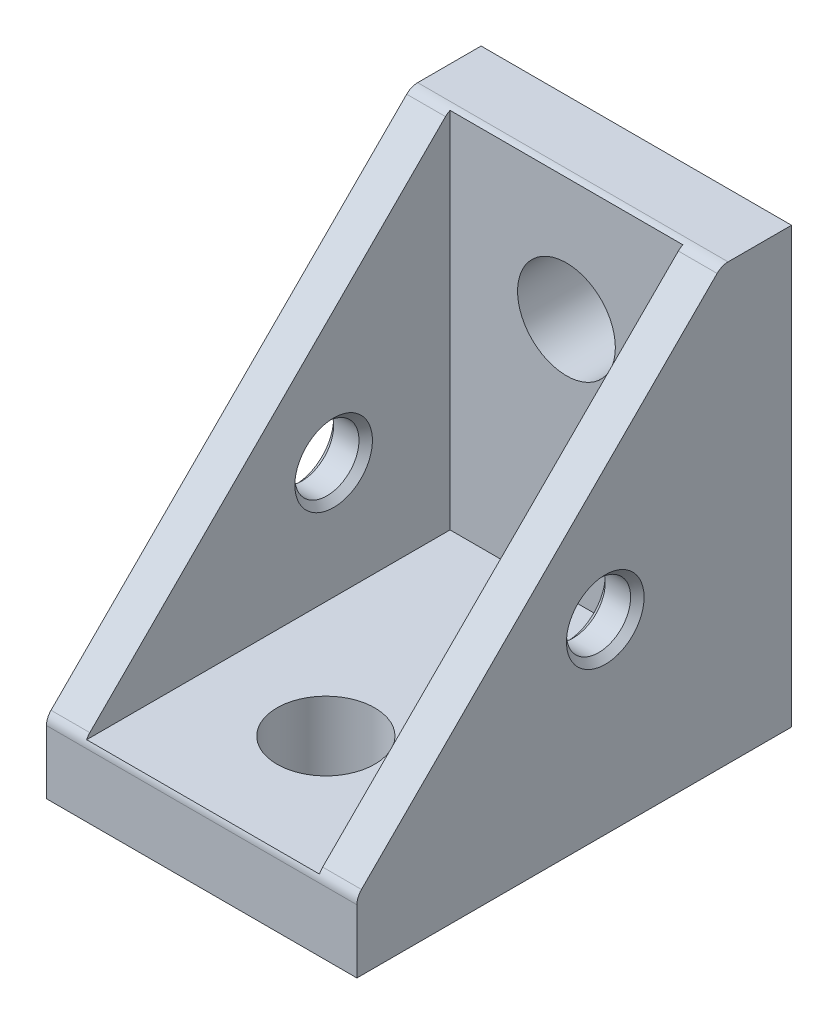
ISO-10303-21;
HEADER;
FILE_DESCRIPTION(('STEP AP214'),'2;1');
FILE_NAME('part.step','',(''),(''),'','','');
FILE_SCHEMA(('AUTOMOTIVE_DESIGN { 1 0 10303 214 1 1 1 1 }'));
ENDSEC;
DATA;
#1=APPLICATION_CONTEXT('core data for automotive mechanical design processes');
#2=APPLICATION_PROTOCOL_DEFINITION('international standard','automotive_design',2000,#1);
#3=PRODUCT_CONTEXT('',#1,'mechanical');
#4=PRODUCT('Part','Part','',(#3));
#5=PRODUCT_RELATED_PRODUCT_CATEGORY('part','',(#4));
#6=PRODUCT_DEFINITION_FORMATION('','',#4);
#7=PRODUCT_DEFINITION_CONTEXT('part definition',#1,'design');
#8=PRODUCT_DEFINITION('design','',#6,#7);
#9=PRODUCT_DEFINITION_SHAPE('','',#8);
#10=(LENGTH_UNIT() NAMED_UNIT(*) SI_UNIT(.MILLI.,.METRE.));
#11=(NAMED_UNIT(*) PLANE_ANGLE_UNIT() SI_UNIT($,.RADIAN.));
#12=(NAMED_UNIT(*) SI_UNIT($,.STERADIAN.) SOLID_ANGLE_UNIT());
#13=UNCERTAINTY_MEASURE_WITH_UNIT(LENGTH_MEASURE(1.E-05),#10,'distance_accuracy_value','');
#14=(GEOMETRIC_REPRESENTATION_CONTEXT(3) GLOBAL_UNCERTAINTY_ASSIGNED_CONTEXT((#13)) GLOBAL_UNIT_ASSIGNED_CONTEXT((#10,
#11,#12)) REPRESENTATION_CONTEXT('',''));
#15=CARTESIAN_POINT('',(0.,0.,0.));
#16=DIRECTION('',(0.,0.,1.));
#17=DIRECTION('',(1.,0.,0.));
#18=AXIS2_PLACEMENT_3D('',#15,#16,#17);
#19=CARTESIAN_POINT('',(-10.,16.25,16.25));
#20=DIRECTION('',(1.,0.,0.));
#21=DIRECTION('',(0.,0.,-1.));
#22=AXIS2_PLACEMENT_3D('',#19,#20,#21);
#23=PLANE('',#22);
#24=CARTESIAN_POINT('',(-10.,12.,12.));
#25=DIRECTION('',(1.,0.,0.));
#26=DIRECTION('',(0.,0.,-1.));
#27=AXIS2_PLACEMENT_3D('',#24,#25,#26);
#28=CIRCLE('',#27,2.49999999999998);
#29=CARTESIAN_POINT('',(-10.,12.,9.50000000000002));
#30=VERTEX_POINT('',#29);
#31=EDGE_CURVE('E233',#30,#30,#28,.T.);
#32=ORIENTED_EDGE('',*,*,#31,.T.);
#33=EDGE_LOOP('',(#32));
#34=FACE_BOUND('',#33,.T.);
#35=DIRECTION('',(0.,1.,0.));
#36=VECTOR('',#35,1.);
#37=CARTESIAN_POINT('',(-10.,0.,28.));
#38=LINE('',#37,#36);
#39=CARTESIAN_POINT('',(-10.,0.,28.));
#40=VERTEX_POINT('',#39);
#41=CARTESIAN_POINT('',(-10.,4.08578643762689,28.));
#42=VERTEX_POINT('',#41);
#43=EDGE_CURVE('E131',#40,#42,#38,.T.);
#44=ORIENTED_EDGE('',*,*,#43,.T.);
#45=CARTESIAN_POINT('',(-10.,4.08578643762689,27.));
#46=DIRECTION('',(1.,0.,0.));
#47=DIRECTION('',(0.,0.,-1.));
#48=AXIS2_PLACEMENT_3D('',#45,#46,#47);
#49=CIRCLE('',#48,1.00000000000004);
#50=CARTESIAN_POINT('',(-10.,4.79289321881346,27.7071067811865));
#51=VERTEX_POINT('',#50);
#52=EDGE_CURVE('E255',#42,#51,#49,.F.);
#53=ORIENTED_EDGE('',*,*,#52,.T.);
#54=CARTESIAN_POINT('',(-10.,4.79289321881346,27.7071067811865));
#55=CARTESIAN_POINT('',(-10.,12.4309644062712,20.0690355937288));
#56=CARTESIAN_POINT('',(-10.,20.0690355937289,12.4309644062712));
#57=CARTESIAN_POINT('',(-10.,27.7071067811866,4.79289321881346));
#58=B_SPLINE_CURVE_WITH_KNOTS('',3,(#54,#55,#56,#57),.UNSPECIFIED.,.F.,.F.,(4,4),(0.,1.),.UNSPECIFIED.);
#59=CARTESIAN_POINT('',(-10.,27.7071067811866,4.79289321881346));
#60=VERTEX_POINT('',#59);
#61=EDGE_CURVE('E190',#51,#60,#58,.T.);
#62=ORIENTED_EDGE('',*,*,#61,.T.);
#63=CARTESIAN_POINT('',(-10.,27.,4.08578643762715));
#64=DIRECTION('',(1.,0.,0.));
#65=DIRECTION('',(0.,0.,-1.));
#66=AXIS2_PLACEMENT_3D('',#63,#64,#65);
#67=CIRCLE('',#66,1.00000000000004);
#68=CARTESIAN_POINT('',(-10.,28.,4.08578643762715));
#69=VERTEX_POINT('',#68);
#70=EDGE_CURVE('E55',#60,#69,#67,.F.);
#71=ORIENTED_EDGE('',*,*,#70,.T.);
#72=DIRECTION('',(0.,0.,1.));
#73=VECTOR('',#72,1.);
#74=CARTESIAN_POINT('',(-10.,28.,0.));
#75=LINE('',#74,#73);
#76=CARTESIAN_POINT('',(-10.,28.,0.));
#77=VERTEX_POINT('',#76);
#78=EDGE_CURVE('E188',#77,#69,#75,.T.);
#79=ORIENTED_EDGE('',*,*,#78,.F.);
#80=DIRECTION('',(0.,1.,0.));
#81=VECTOR('',#80,1.);
#82=CARTESIAN_POINT('',(-10.,28.,0.));
#83=LINE('',#82,#81);
#84=CARTESIAN_POINT('',(-10.,0.,0.));
#85=VERTEX_POINT('',#84);
#86=EDGE_CURVE('E185',#85,#77,#83,.T.);
#87=ORIENTED_EDGE('',*,*,#86,.F.);
#88=DIRECTION('',(0.,0.,-1.));
#89=VECTOR('',#88,1.);
#90=CARTESIAN_POINT('',(-10.,0.,0.));
#91=LINE('',#90,#89);
#92=EDGE_CURVE('E129',#40,#85,#91,.T.);
#93=ORIENTED_EDGE('',*,*,#92,.F.);
#94=EDGE_LOOP('',(#44,#53,#62,#71,#79,#87,#93));
#95=FACE_BOUND('',#94,.T.);
#96=ADVANCED_FACE('F33',(#34,#95),#23,.F.);
#97=CARTESIAN_POINT('',(7.5,0.,0.));
#98=DIRECTION('',(1.,0.,0.));
#99=DIRECTION('',(0.,0.,-1.));
#100=AXIS2_PLACEMENT_3D('',#97,#98,#99);
#101=PLANE('',#100);
#102=CARTESIAN_POINT('',(7.5,12.,12.));
#103=DIRECTION('',(1.,0.,0.));
#104=DIRECTION('',(0.,0.,-1.));
#105=AXIS2_PLACEMENT_3D('',#102,#103,#104);
#106=CIRCLE('',#105,2.49999999999998);
#107=CARTESIAN_POINT('',(7.5,12.,9.50000000000002));
#108=VERTEX_POINT('',#107);
#109=EDGE_CURVE('E221',#108,#108,#106,.T.);
#110=ORIENTED_EDGE('',*,*,#109,.T.);
#111=EDGE_LOOP('',(#110));
#112=FACE_BOUND('',#111,.T.);
#113=DIRECTION('',(0.,0.,-1.));
#114=VECTOR('',#113,1.);
#115=CARTESIAN_POINT('',(7.5,4.5,28.));
#116=LINE('',#115,#114);
#117=CARTESIAN_POINT('',(7.5,4.5,27.9101797211245));
#118=VERTEX_POINT('',#117);
#119=CARTESIAN_POINT('',(7.5,4.5,4.5));
#120=VERTEX_POINT('',#119);
#121=EDGE_CURVE('E165',#118,#120,#116,.T.);
#122=ORIENTED_EDGE('',*,*,#121,.F.);
#123=CARTESIAN_POINT('',(7.5,4.08578643762688,27.));
#124=DIRECTION('',(1.,0.,0.));
#125=DIRECTION('',(0.,0.,-1.));
#126=AXIS2_PLACEMENT_3D('',#123,#124,#125);
#127=CIRCLE('',#126,1.00000000000004);
#128=CARTESIAN_POINT('',(7.5,4.79289321881346,27.7071067811865));
#129=VERTEX_POINT('',#128);
#130=EDGE_CURVE('E243',#118,#129,#127,.F.);
#131=ORIENTED_EDGE('',*,*,#130,.T.);
#132=CARTESIAN_POINT('',(7.5,27.7071067811866,4.79289321881346));
#133=CARTESIAN_POINT('',(7.5,20.0690355937289,12.4309644062712));
#134=CARTESIAN_POINT('',(7.5,12.4309644062712,20.0690355937288));
#135=CARTESIAN_POINT('',(7.5,4.79289321881346,27.7071067811865));
#136=B_SPLINE_CURVE_WITH_KNOTS('',3,(#132,#133,#134,#135),.UNSPECIFIED.,.F.,.F.,(4,4),(0.,1.),.UNSPECIFIED.);
#137=CARTESIAN_POINT('',(7.5,27.7071067811866,4.79289321881346));
#138=VERTEX_POINT('',#137);
#139=EDGE_CURVE('E149',#138,#129,#136,.T.);
#140=ORIENTED_EDGE('',*,*,#139,.F.);
#141=CARTESIAN_POINT('',(7.5,27.,4.08578643762695));
#142=DIRECTION('',(1.,0.,0.));
#143=DIRECTION('',(0.,0.,-1.));
#144=AXIS2_PLACEMENT_3D('',#141,#142,#143);
#145=CIRCLE('',#144,1.00000000000004);
#146=CARTESIAN_POINT('',(7.5,27.9101797211245,4.5));
#147=VERTEX_POINT('',#146);
#148=EDGE_CURVE('E240',#138,#147,#145,.F.);
#149=ORIENTED_EDGE('',*,*,#148,.T.);
#150=DIRECTION('',(0.,1.,0.));
#151=VECTOR('',#150,1.);
#152=CARTESIAN_POINT('',(7.5,4.5,4.5));
#153=LINE('',#152,#151);
#154=EDGE_CURVE('E177',#120,#147,#153,.T.);
#155=ORIENTED_EDGE('',*,*,#154,.F.);
#156=EDGE_LOOP('',(#122,#131,#140,#149,#155));
#157=FACE_BOUND('',#156,.T.);
#158=ADVANCED_FACE('F283',(#112,#157),#101,.F.);
#159=CARTESIAN_POINT('',(7.5,28.,28.));
#160=DIRECTION('',(0.,0.,1.));
#161=DIRECTION('',(1.,0.,0.));
#162=AXIS2_PLACEMENT_3D('',#159,#160,#161);
#163=PLANE('',#162);
#164=DIRECTION('',(0.,-1.,0.));
#165=VECTOR('',#164,1.);
#166=CARTESIAN_POINT('',(10.,0.,28.));
#167=LINE('',#166,#165);
#168=CARTESIAN_POINT('',(10.,4.08578643762688,28.));
#169=VERTEX_POINT('',#168);
#170=CARTESIAN_POINT('',(10.,0.,28.));
#171=VERTEX_POINT('',#170);
#172=EDGE_CURVE('E147',#169,#171,#167,.T.);
#173=ORIENTED_EDGE('',*,*,#172,.F.);
#174=DIRECTION('',(-1.,0.,0.));
#175=VECTOR('',#174,1.);
#176=CARTESIAN_POINT('',(7.49999999999999,4.08578643762689,28.));
#177=LINE('',#176,#175);
#178=EDGE_CURVE('E236',#169,#42,#177,.T.);
#179=ORIENTED_EDGE('',*,*,#178,.T.);
#180=ORIENTED_EDGE('',*,*,#43,.F.);
#181=DIRECTION('',(-1.,0.,0.));
#182=VECTOR('',#181,1.);
#183=CARTESIAN_POINT('',(-10.,0.,28.));
#184=LINE('',#183,#182);
#185=EDGE_CURVE('E180',#171,#40,#184,.T.);
#186=ORIENTED_EDGE('',*,*,#185,.F.);
#187=EDGE_LOOP('',(#173,#179,#180,#186));
#188=FACE_BOUND('',#187,.T.);
#189=ADVANCED_FACE('F300',(#188),#163,.T.);
#190=CARTESIAN_POINT('',(-7.5,4.5,28.));
#191=DIRECTION('',(0.,0.707106781186543,0.707106781186552));
#192=DIRECTION('',(0.,-0.707106781186552,0.707106781186543));
#193=AXIS2_PLACEMENT_3D('',#190,#191,#192);
#194=PLANE('',#193);
#195=ORIENTED_EDGE('',*,*,#61,.F.);
#196=DIRECTION('',(-1.,0.,0.));
#197=VECTOR('',#196,1.);
#198=CARTESIAN_POINT('',(-7.5,4.79289321881346,27.7071067811865));
#199=LINE('',#198,#197);
#200=CARTESIAN_POINT('',(-7.5,4.79289321881346,27.7071067811865));
#201=VERTEX_POINT('',#200);
#202=EDGE_CURVE('E259',#51,#201,#199,.F.);
#203=ORIENTED_EDGE('',*,*,#202,.T.);
#204=CARTESIAN_POINT('',(-7.5,4.79289321881346,27.7071067811865));
#205=CARTESIAN_POINT('',(-7.5,12.4309644062712,20.0690355937288));
#206=CARTESIAN_POINT('',(-7.5,20.0690355937289,12.4309644062712));
#207=CARTESIAN_POINT('',(-7.5,27.7071067811866,4.79289321881346));
#208=B_SPLINE_CURVE_WITH_KNOTS('',3,(#204,#205,#206,#207),.UNSPECIFIED.,.F.,.F.,(4,4),(0.,1.),.UNSPECIFIED.);
#209=CARTESIAN_POINT('',(-7.5,27.7071067811867,4.79289321881358));
#210=VERTEX_POINT('',#209);
#211=EDGE_CURVE('E191',#201,#210,#208,.T.);
#212=ORIENTED_EDGE('',*,*,#211,.T.);
#213=DIRECTION('',(-1.,0.,0.));
#214=VECTOR('',#213,1.);
#215=CARTESIAN_POINT('',(-10.,27.7071067811865,4.79289321881374));
#216=LINE('',#215,#214);
#217=EDGE_CURVE('E257',#210,#60,#216,.T.);
#218=ORIENTED_EDGE('',*,*,#217,.T.);
#219=EDGE_LOOP('',(#195,#203,#212,#218));
#220=FACE_BOUND('',#219,.T.);
#221=ADVANCED_FACE('F297',(#220),#194,.T.);
#222=CARTESIAN_POINT('',(0.,28.,0.));
#223=DIRECTION('',(0.,-1.,0.));
#224=DIRECTION('',(0.,0.,-1.));
#225=AXIS2_PLACEMENT_3D('',#222,#223,#224);
#226=PLANE('',#225);
#227=DIRECTION('',(-1.,0.,0.));
#228=VECTOR('',#227,1.);
#229=CARTESIAN_POINT('',(-7.5,28.,4.08578643762715));
#230=LINE('',#229,#228);
#231=CARTESIAN_POINT('',(10.,28.,4.08578643762695));
#232=VERTEX_POINT('',#231);
#233=EDGE_CURVE('E11',#69,#232,#230,.F.);
#234=ORIENTED_EDGE('',*,*,#233,.T.);
#235=DIRECTION('',(0.,0.,1.));
#236=VECTOR('',#235,1.);
#237=CARTESIAN_POINT('',(10.,28.,4.50000000000001));
#238=LINE('',#237,#236);
#239=CARTESIAN_POINT('',(10.,28.,0.));
#240=VERTEX_POINT('',#239);
#241=EDGE_CURVE('E141',#240,#232,#238,.T.);
#242=ORIENTED_EDGE('',*,*,#241,.F.);
#243=DIRECTION('',(1.,0.,0.));
#244=VECTOR('',#243,1.);
#245=CARTESIAN_POINT('',(7.5,28.,0.));
#246=LINE('',#245,#244);
#247=EDGE_CURVE('E137',#77,#240,#246,.T.);
#248=ORIENTED_EDGE('',*,*,#247,.F.);
#249=ORIENTED_EDGE('',*,*,#78,.T.);
#250=EDGE_LOOP('',(#234,#242,#248,#249));
#251=FACE_BOUND('',#250,.T.);
#252=ADVANCED_FACE('F302',(#251),#226,.F.);
#253=CARTESIAN_POINT('',(0.,0.,0.));
#254=DIRECTION('',(0.,0.,1.));
#255=DIRECTION('',(1.,0.,0.));
#256=AXIS2_PLACEMENT_3D('',#253,#254,#255);
#257=PLANE('',#256);
#258=CARTESIAN_POINT('',(0.,20.,0.));
#259=DIRECTION('',(0.,0.,1.));
#260=DIRECTION('',(1.,0.,0.));
#261=AXIS2_PLACEMENT_3D('',#258,#259,#260);
#262=CIRCLE('',#261,3.15);
#263=CARTESIAN_POINT('',(3.15,20.,0.));
#264=VERTEX_POINT('',#263);
#265=EDGE_CURVE('E535',#264,#264,#262,.T.);
#266=ORIENTED_EDGE('',*,*,#265,.T.);
#267=EDGE_LOOP('',(#266));
#268=FACE_BOUND('',#267,.T.);
#269=ORIENTED_EDGE('',*,*,#247,.T.);
#270=DIRECTION('',(0.,1.,0.));
#271=VECTOR('',#270,1.);
#272=CARTESIAN_POINT('',(10.,28.,0.));
#273=LINE('',#272,#271);
#274=CARTESIAN_POINT('',(10.,0.,0.));
#275=VERTEX_POINT('',#274);
#276=EDGE_CURVE('E134',#275,#240,#273,.T.);
#277=ORIENTED_EDGE('',*,*,#276,.F.);
#278=DIRECTION('',(1.,0.,0.));
#279=VECTOR('',#278,1.);
#280=CARTESIAN_POINT('',(7.5,0.,0.));
#281=LINE('',#280,#279);
#282=EDGE_CURVE('E123',#85,#275,#281,.T.);
#283=ORIENTED_EDGE('',*,*,#282,.F.);
#284=ORIENTED_EDGE('',*,*,#86,.T.);
#285=EDGE_LOOP('',(#269,#277,#283,#284));
#286=FACE_BOUND('',#285,.T.);
#287=ADVANCED_FACE('F135',(#268,#286),#257,.F.);
#288=CARTESIAN_POINT('',(0.,0.,0.));
#289=DIRECTION('',(0.,1.,0.));
#290=DIRECTION('',(0.,0.,1.));
#291=AXIS2_PLACEMENT_3D('',#288,#289,#290);
#292=PLANE('',#291);
#293=CARTESIAN_POINT('',(0.,0.,20.));
#294=DIRECTION('',(0.,1.,0.));
#295=DIRECTION('',(0.,0.,1.));
#296=AXIS2_PLACEMENT_3D('',#293,#294,#295);
#297=CIRCLE('',#296,3.15);
#298=CARTESIAN_POINT('',(0.,0.,23.15));
#299=VERTEX_POINT('',#298);
#300=EDGE_CURVE('E152',#299,#299,#297,.T.);
#301=ORIENTED_EDGE('',*,*,#300,.T.);
#302=EDGE_LOOP('',(#301));
#303=FACE_BOUND('',#302,.T.);
#304=ORIENTED_EDGE('',*,*,#282,.T.);
#305=DIRECTION('',(0.,0.,-1.));
#306=VECTOR('',#305,1.);
#307=CARTESIAN_POINT('',(10.,0.,0.));
#308=LINE('',#307,#306);
#309=EDGE_CURVE('E127',#171,#275,#308,.T.);
#310=ORIENTED_EDGE('',*,*,#309,.F.);
#311=ORIENTED_EDGE('',*,*,#185,.T.);
#312=ORIENTED_EDGE('',*,*,#92,.T.);
#313=EDGE_LOOP('',(#304,#310,#311,#312));
#314=FACE_BOUND('',#313,.T.);
#315=ADVANCED_FACE('F125',(#303,#314),#292,.F.);
#316=CARTESIAN_POINT('',(-7.5,4.5,4.5));
#317=DIRECTION('',(-1.,0.,0.));
#318=DIRECTION('',(0.,0.,1.));
#319=AXIS2_PLACEMENT_3D('',#316,#317,#318);
#320=PLANE('',#319);
#321=CARTESIAN_POINT('',(-7.5,12.,12.));
#322=DIRECTION('',(-1.,0.,0.));
#323=DIRECTION('',(0.,0.,1.));
#324=AXIS2_PLACEMENT_3D('',#321,#322,#323);
#325=CIRCLE('',#324,2.49999999999999);
#326=CARTESIAN_POINT('',(-7.5,12.,14.5));
#327=VERTEX_POINT('',#326);
#328=EDGE_CURVE('E224',#327,#327,#325,.T.);
#329=ORIENTED_EDGE('',*,*,#328,.T.);
#330=EDGE_LOOP('',(#329));
#331=FACE_BOUND('',#330,.T.);
#332=ORIENTED_EDGE('',*,*,#211,.F.);
#333=CARTESIAN_POINT('',(-7.5,4.08578643762689,27.));
#334=DIRECTION('',(-1.,0.,0.));
#335=DIRECTION('',(0.,0.,1.));
#336=AXIS2_PLACEMENT_3D('',#333,#334,#335);
#337=CIRCLE('',#336,1.00000000000004);
#338=CARTESIAN_POINT('',(-7.5,4.5,27.9101797211245));
#339=VERTEX_POINT('',#338);
#340=EDGE_CURVE('E263',#201,#339,#337,.F.);
#341=ORIENTED_EDGE('',*,*,#340,.T.);
#342=DIRECTION('',(0.,0.,1.));
#343=VECTOR('',#342,1.);
#344=CARTESIAN_POINT('',(-7.5,4.5,4.5));
#345=LINE('',#344,#343);
#346=CARTESIAN_POINT('',(-7.5,4.5,4.5));
#347=VERTEX_POINT('',#346);
#348=EDGE_CURVE('E176',#347,#339,#345,.T.);
#349=ORIENTED_EDGE('',*,*,#348,.F.);
#350=DIRECTION('',(0.,1.,0.));
#351=VECTOR('',#350,1.);
#352=CARTESIAN_POINT('',(-7.5,4.5,4.5));
#353=LINE('',#352,#351);
#354=CARTESIAN_POINT('',(-7.5,27.9101797211246,4.5));
#355=VERTEX_POINT('',#354);
#356=EDGE_CURVE('E179',#347,#355,#353,.T.);
#357=ORIENTED_EDGE('',*,*,#356,.T.);
#358=CARTESIAN_POINT('',(-7.5,27.,4.08578643762715));
#359=DIRECTION('',(-1.,0.,0.));
#360=DIRECTION('',(0.,0.,1.));
#361=AXIS2_PLACEMENT_3D('',#358,#359,#360);
#362=CIRCLE('',#361,1.00000000000004);
#363=EDGE_CURVE('E261',#355,#210,#362,.F.);
#364=ORIENTED_EDGE('',*,*,#363,.T.);
#365=EDGE_LOOP('',(#332,#341,#349,#357,#364));
#366=FACE_BOUND('',#365,.T.);
#367=ADVANCED_FACE('F268',(#331,#366),#320,.F.);
#368=CARTESIAN_POINT('',(7.5,4.5,4.5));
#369=DIRECTION('',(0.,0.,-1.));
#370=DIRECTION('',(-1.,0.,0.));
#371=AXIS2_PLACEMENT_3D('',#368,#369,#370);
#372=PLANE('',#371);
#373=CARTESIAN_POINT('',(0.,20.,4.5));
#374=DIRECTION('',(0.,0.,1.));
#375=DIRECTION('',(1.,0.,0.));
#376=AXIS2_PLACEMENT_3D('',#373,#374,#375);
#377=CIRCLE('',#376,3.14999999999999);
#378=CARTESIAN_POINT('',(3.14999999999999,20.,4.5));
#379=VERTEX_POINT('',#378);
#380=EDGE_CURVE('E539',#379,#379,#377,.T.);
#381=ORIENTED_EDGE('',*,*,#380,.F.);
#382=EDGE_LOOP('',(#381));
#383=FACE_BOUND('',#382,.T.);
#384=ORIENTED_EDGE('',*,*,#154,.T.);
#385=DIRECTION('',(1.,0.,0.));
#386=VECTOR('',#385,1.);
#387=CARTESIAN_POINT('',(7.5,27.9101797211246,4.5));
#388=LINE('',#387,#386);
#389=EDGE_CURVE('E41',#147,#355,#388,.F.);
#390=ORIENTED_EDGE('',*,*,#389,.T.);
#391=ORIENTED_EDGE('',*,*,#356,.F.);
#392=DIRECTION('',(-1.,0.,0.));
#393=VECTOR('',#392,1.);
#394=CARTESIAN_POINT('',(7.5,4.5,4.5));
#395=LINE('',#394,#393);
#396=EDGE_CURVE('E173',#120,#347,#395,.T.);
#397=ORIENTED_EDGE('',*,*,#396,.F.);
#398=EDGE_LOOP('',(#384,#390,#391,#397));
#399=FACE_BOUND('',#398,.T.);
#400=ADVANCED_FACE('F293',(#383,#399),#372,.F.);
#401=CARTESIAN_POINT('',(0.,4.5,0.));
#402=DIRECTION('',(0.,1.,0.));
#403=DIRECTION('',(0.,0.,1.));
#404=AXIS2_PLACEMENT_3D('',#401,#402,#403);
#405=PLANE('',#404);
#406=CARTESIAN_POINT('',(0.,4.5,20.));
#407=DIRECTION('',(0.,1.,0.));
#408=DIRECTION('',(0.,0.,1.));
#409=AXIS2_PLACEMENT_3D('',#406,#407,#408);
#410=CIRCLE('',#409,3.14999999999999);
#411=CARTESIAN_POINT('',(0.,4.5,23.15));
#412=VERTEX_POINT('',#411);
#413=EDGE_CURVE('E533',#412,#412,#410,.T.);
#414=ORIENTED_EDGE('',*,*,#413,.F.);
#415=EDGE_LOOP('',(#414));
#416=FACE_BOUND('',#415,.T.);
#417=DIRECTION('',(-1.,0.,0.));
#418=VECTOR('',#417,1.);
#419=CARTESIAN_POINT('',(-7.5,4.5,27.9101797211245));
#420=LINE('',#419,#418);
#421=EDGE_CURVE('E238',#339,#118,#420,.F.);
#422=ORIENTED_EDGE('',*,*,#421,.T.);
#423=ORIENTED_EDGE('',*,*,#121,.T.);
#424=ORIENTED_EDGE('',*,*,#396,.T.);
#425=ORIENTED_EDGE('',*,*,#348,.T.);
#426=EDGE_LOOP('',(#422,#423,#424,#425));
#427=FACE_BOUND('',#426,.T.);
#428=ADVANCED_FACE('F273',(#416,#427),#405,.T.);
#429=CARTESIAN_POINT('',(10.,4.5,28.));
#430=DIRECTION('',(0.,-0.707106781186546,-0.707106781186548));
#431=DIRECTION('',(0.,0.707106781186549,-0.707106781186547));
#432=AXIS2_PLACEMENT_3D('',#429,#430,#431);
#433=PLANE('',#432);
#434=ORIENTED_EDGE('',*,*,#139,.T.);
#435=DIRECTION('',(-1.,0.,0.));
#436=VECTOR('',#435,1.);
#437=CARTESIAN_POINT('',(10.,4.79289321881346,27.7071067811865));
#438=LINE('',#437,#436);
#439=CARTESIAN_POINT('',(10.,4.79289321881346,27.7071067811865));
#440=VERTEX_POINT('',#439);
#441=EDGE_CURVE('E248',#129,#440,#438,.F.);
#442=ORIENTED_EDGE('',*,*,#441,.T.);
#443=CARTESIAN_POINT('',(10.,27.7071067811866,4.79289321881346));
#444=CARTESIAN_POINT('',(10.,20.0690355937289,12.4309644062712));
#445=CARTESIAN_POINT('',(10.,12.4309644062712,20.0690355937288));
#446=CARTESIAN_POINT('',(10.,4.79289321881346,27.7071067811865));
#447=B_SPLINE_CURVE_WITH_KNOTS('',3,(#443,#444,#445,#446),.UNSPECIFIED.,.F.,.F.,(4,4),(0.,1.),.UNSPECIFIED.);
#448=CARTESIAN_POINT('',(10.,27.7071067811866,4.79289321881346));
#449=VERTEX_POINT('',#448);
#450=EDGE_CURVE('E158',#449,#440,#447,.T.);
#451=ORIENTED_EDGE('',*,*,#450,.F.);
#452=DIRECTION('',(-1.,0.,0.));
#453=VECTOR('',#452,1.);
#454=CARTESIAN_POINT('',(10.,27.7071067811865,4.79289321881353));
#455=LINE('',#454,#453);
#456=EDGE_CURVE('E245',#449,#138,#455,.T.);
#457=ORIENTED_EDGE('',*,*,#456,.T.);
#458=EDGE_LOOP('',(#434,#442,#451,#457));
#459=FACE_BOUND('',#458,.T.);
#460=ADVANCED_FACE('F286',(#459),#433,.F.);
#461=CARTESIAN_POINT('',(10.,0.,0.));
#462=DIRECTION('',(1.,0.,0.));
#463=DIRECTION('',(0.,0.,-1.));
#464=AXIS2_PLACEMENT_3D('',#461,#462,#463);
#465=PLANE('',#464);
#466=CARTESIAN_POINT('',(10.,12.,12.));
#467=DIRECTION('',(1.,0.,0.));
#468=DIRECTION('',(0.,0.,-1.));
#469=AXIS2_PLACEMENT_3D('',#466,#467,#468);
#470=CIRCLE('',#469,2.49999999999999);
#471=CARTESIAN_POINT('',(10.,12.,9.50000000000001));
#472=VERTEX_POINT('',#471);
#473=EDGE_CURVE('E196',#472,#472,#470,.F.);
#474=ORIENTED_EDGE('',*,*,#473,.T.);
#475=EDGE_LOOP('',(#474));
#476=FACE_BOUND('',#475,.T.);
#477=ORIENTED_EDGE('',*,*,#450,.T.);
#478=CARTESIAN_POINT('',(10.,4.08578643762688,27.));
#479=DIRECTION('',(1.,0.,0.));
#480=DIRECTION('',(0.,0.,-1.));
#481=AXIS2_PLACEMENT_3D('',#478,#479,#480);
#482=CIRCLE('',#481,1.00000000000004);
#483=EDGE_CURVE('E252',#440,#169,#482,.T.);
#484=ORIENTED_EDGE('',*,*,#483,.T.);
#485=ORIENTED_EDGE('',*,*,#172,.T.);
#486=ORIENTED_EDGE('',*,*,#309,.T.);
#487=ORIENTED_EDGE('',*,*,#276,.T.);
#488=ORIENTED_EDGE('',*,*,#241,.T.);
#489=CARTESIAN_POINT('',(10.,27.,4.08578643762695));
#490=DIRECTION('',(1.,0.,0.));
#491=DIRECTION('',(0.,0.,-1.));
#492=AXIS2_PLACEMENT_3D('',#489,#490,#491);
#493=CIRCLE('',#492,1.00000000000004);
#494=EDGE_CURVE('E250',#232,#449,#493,.T.);
#495=ORIENTED_EDGE('',*,*,#494,.T.);
#496=EDGE_LOOP('',(#477,#484,#485,#486,#487,#488,#495));
#497=FACE_BOUND('',#496,.T.);
#498=ADVANCED_FACE('F144',(#476,#497),#465,.T.);
#499=CARTESIAN_POINT('',(7.5,12.,12.));
#500=DIRECTION('',(-1.,0.,0.));
#501=DIRECTION('',(0.,0.,1.));
#502=AXIS2_PLACEMENT_3D('',#499,#500,#501);
#503=CYLINDRICAL_SURFACE('',#502,2.06699999999999);
#504=CARTESIAN_POINT('',(9.567,12.,12.));
#505=DIRECTION('',(1.,0.,0.));
#506=DIRECTION('',(0.,0.,-1.));
#507=AXIS2_PLACEMENT_3D('',#504,#505,#506);
#508=CIRCLE('',#507,2.06699999999999);
#509=CARTESIAN_POINT('',(9.567,12.,9.93300000000001));
#510=VERTEX_POINT('',#509);
#511=EDGE_CURVE('E218',#510,#510,#508,.T.);
#512=ORIENTED_EDGE('',*,*,#511,.T.);
#513=EDGE_LOOP('',(#512));
#514=FACE_BOUND('',#513,.T.);
#515=CARTESIAN_POINT('',(7.93299999999999,12.,12.));
#516=DIRECTION('',(1.,0.,0.));
#517=DIRECTION('',(0.,0.,-1.));
#518=AXIS2_PLACEMENT_3D('',#515,#516,#517);
#519=CIRCLE('',#518,2.06699999999999);
#520=CARTESIAN_POINT('',(7.93299999999999,12.,9.93300000000001));
#521=VERTEX_POINT('',#520);
#522=EDGE_CURVE('E215',#521,#521,#519,.F.);
#523=ORIENTED_EDGE('',*,*,#522,.T.);
#524=EDGE_LOOP('',(#523));
#525=FACE_BOUND('',#524,.T.);
#526=ADVANCED_FACE('F358',(#514,#525),#503,.F.);
#527=CARTESIAN_POINT('',(0.,4.5,20.));
#528=DIRECTION('',(0.,1.,0.));
#529=DIRECTION('',(0.,0.,1.));
#530=AXIS2_PLACEMENT_3D('',#527,#528,#529);
#531=CYLINDRICAL_SURFACE('',#530,3.14999999999999);
#532=ORIENTED_EDGE('',*,*,#300,.F.);
#533=EDGE_LOOP('',(#532));
#534=FACE_BOUND('',#533,.T.);
#535=ORIENTED_EDGE('',*,*,#413,.T.);
#536=EDGE_LOOP('',(#535));
#537=FACE_BOUND('',#536,.T.);
#538=ADVANCED_FACE('F472',(#534,#537),#531,.F.);
#539=CARTESIAN_POINT('',(0.,20.,4.5));
#540=DIRECTION('',(0.,0.,1.));
#541=DIRECTION('',(1.,0.,0.));
#542=AXIS2_PLACEMENT_3D('',#539,#540,#541);
#543=CYLINDRICAL_SURFACE('',#542,3.14999999999999);
#544=ORIENTED_EDGE('',*,*,#265,.F.);
#545=EDGE_LOOP('',(#544));
#546=FACE_BOUND('',#545,.T.);
#547=ORIENTED_EDGE('',*,*,#380,.T.);
#548=EDGE_LOOP('',(#547));
#549=FACE_BOUND('',#548,.T.);
#550=ADVANCED_FACE('F463',(#546,#549),#543,.F.);
#551=CARTESIAN_POINT('',(-10.,12.,12.));
#552=DIRECTION('',(-1.,0.,0.));
#553=DIRECTION('',(0.,0.,1.));
#554=AXIS2_PLACEMENT_3D('',#551,#552,#553);
#555=CYLINDRICAL_SURFACE('',#554,2.06699999999999);
#556=CARTESIAN_POINT('',(-7.933,12.,12.));
#557=DIRECTION('',(-1.,0.,0.));
#558=DIRECTION('',(0.,0.,1.));
#559=AXIS2_PLACEMENT_3D('',#556,#557,#558);
#560=CIRCLE('',#559,2.06699999999999);
#561=CARTESIAN_POINT('',(-7.933,12.,14.067));
#562=VERTEX_POINT('',#561);
#563=EDGE_CURVE('E230',#562,#562,#560,.F.);
#564=ORIENTED_EDGE('',*,*,#563,.T.);
#565=EDGE_LOOP('',(#564));
#566=FACE_BOUND('',#565,.T.);
#567=CARTESIAN_POINT('',(-9.567,12.,12.));
#568=DIRECTION('',(1.,0.,0.));
#569=DIRECTION('',(0.,0.,-1.));
#570=AXIS2_PLACEMENT_3D('',#567,#568,#569);
#571=CIRCLE('',#570,2.06699999999999);
#572=CARTESIAN_POINT('',(-9.567,12.,9.93300000000001));
#573=VERTEX_POINT('',#572);
#574=EDGE_CURVE('E227',#573,#573,#571,.F.);
#575=ORIENTED_EDGE('',*,*,#574,.T.);
#576=EDGE_LOOP('',(#575));
#577=FACE_BOUND('',#576,.T.);
#578=ADVANCED_FACE('F326',(#566,#577),#555,.F.);
#579=CARTESIAN_POINT('',(10.,12.,12.));
#580=DIRECTION('',(1.,0.,0.));
#581=DIRECTION('',(0.,0.,-1.));
#582=AXIS2_PLACEMENT_3D('',#579,#580,#581);
#583=CONICAL_SURFACE('',#582,2.49999999999999,0.785398163397448);
#584=ORIENTED_EDGE('',*,*,#511,.F.);
#585=EDGE_LOOP('',(#584));
#586=FACE_BOUND('',#585,.T.);
#587=ORIENTED_EDGE('',*,*,#473,.F.);
#588=EDGE_LOOP('',(#587));
#589=FACE_BOUND('',#588,.T.);
#590=ADVANCED_FACE('F322',(#586,#589),#583,.F.);
#591=CARTESIAN_POINT('',(7.93299999999999,12.,12.));
#592=DIRECTION('',(-1.,0.,0.));
#593=DIRECTION('',(0.,0.,1.));
#594=AXIS2_PLACEMENT_3D('',#591,#592,#593);
#595=CONICAL_SURFACE('',#594,2.06699999999999,0.785398163397448);
#596=ORIENTED_EDGE('',*,*,#109,.F.);
#597=EDGE_LOOP('',(#596));
#598=FACE_BOUND('',#597,.T.);
#599=ORIENTED_EDGE('',*,*,#522,.F.);
#600=EDGE_LOOP('',(#599));
#601=FACE_BOUND('',#600,.T.);
#602=ADVANCED_FACE('F325',(#598,#601),#595,.F.);
#603=CARTESIAN_POINT('',(-7.5,12.,12.));
#604=DIRECTION('',(1.,0.,0.));
#605=DIRECTION('',(0.,0.,-1.));
#606=AXIS2_PLACEMENT_3D('',#603,#604,#605);
#607=CONICAL_SURFACE('',#606,2.49999999999999,0.785398163397449);
#608=ORIENTED_EDGE('',*,*,#563,.F.);
#609=EDGE_LOOP('',(#608));
#610=FACE_BOUND('',#609,.T.);
#611=ORIENTED_EDGE('',*,*,#328,.F.);
#612=EDGE_LOOP('',(#611));
#613=FACE_BOUND('',#612,.T.);
#614=ADVANCED_FACE('F330',(#610,#613),#607,.F.);
#615=CARTESIAN_POINT('',(-9.567,12.,12.));
#616=DIRECTION('',(-1.,0.,0.));
#617=DIRECTION('',(0.,0.,1.));
#618=AXIS2_PLACEMENT_3D('',#615,#616,#617);
#619=CONICAL_SURFACE('',#618,2.06699999999999,0.785398163397447);
#620=ORIENTED_EDGE('',*,*,#31,.F.);
#621=EDGE_LOOP('',(#620));
#622=FACE_BOUND('',#621,.T.);
#623=ORIENTED_EDGE('',*,*,#574,.F.);
#624=EDGE_LOOP('',(#623));
#625=FACE_BOUND('',#624,.T.);
#626=ADVANCED_FACE('F334',(#622,#625),#619,.F.);
#627=CARTESIAN_POINT('',(7.49999999999999,4.08578643762689,27.));
#628=DIRECTION('',(-1.,0.,0.));
#629=DIRECTION('',(0.,-1.,0.));
#630=AXIS2_PLACEMENT_3D('',#627,#628,#629);
#631=CYLINDRICAL_SURFACE('',#630,1.00000000000004);
#632=ORIENTED_EDGE('',*,*,#52,.F.);
#633=ORIENTED_EDGE('',*,*,#178,.F.);
#634=ORIENTED_EDGE('',*,*,#483,.F.);
#635=ORIENTED_EDGE('',*,*,#441,.F.);
#636=ORIENTED_EDGE('',*,*,#130,.F.);
#637=ORIENTED_EDGE('',*,*,#421,.F.);
#638=ORIENTED_EDGE('',*,*,#340,.F.);
#639=ORIENTED_EDGE('',*,*,#202,.F.);
#640=EDGE_LOOP('',(#632,#633,#634,#635,#636,#637,#638,#639));
#641=FACE_BOUND('',#640,.T.);
#642=ADVANCED_FACE('F278',(#641),#631,.T.);
#643=CARTESIAN_POINT('',(-7.5,27.,4.08578643762715));
#644=DIRECTION('',(1.,0.,0.));
#645=DIRECTION('',(0.,0.,-1.));
#646=AXIS2_PLACEMENT_3D('',#643,#644,#645);
#647=CYLINDRICAL_SURFACE('',#646,1.00000000000004);
#648=ORIENTED_EDGE('',*,*,#363,.F.);
#649=ORIENTED_EDGE('',*,*,#389,.F.);
#650=ORIENTED_EDGE('',*,*,#148,.F.);
#651=ORIENTED_EDGE('',*,*,#456,.F.);
#652=ORIENTED_EDGE('',*,*,#494,.F.);
#653=ORIENTED_EDGE('',*,*,#233,.F.);
#654=ORIENTED_EDGE('',*,*,#70,.F.);
#655=ORIENTED_EDGE('',*,*,#217,.F.);
#656=EDGE_LOOP('',(#648,#649,#650,#651,#652,#653,#654,#655));
#657=FACE_BOUND('',#656,.T.);
#658=ADVANCED_FACE('F35',(#657),#647,.T.);
#659=CLOSED_SHELL('',(#96,#158,#189,#221,#252,#287,#315,#367,#400,#428,#460,#498,#526,#538,#550,
#578,#590,#602,#614,#626,#642,#658));
#660=MANIFOLD_SOLID_BREP('B2',#659);
#661=ADVANCED_BREP_SHAPE_REPRESENTATION('',(#18,#660),#14);
#662=SHAPE_DEFINITION_REPRESENTATION(#9,#661);
ENDSEC;
END-ISO-10303-21;
